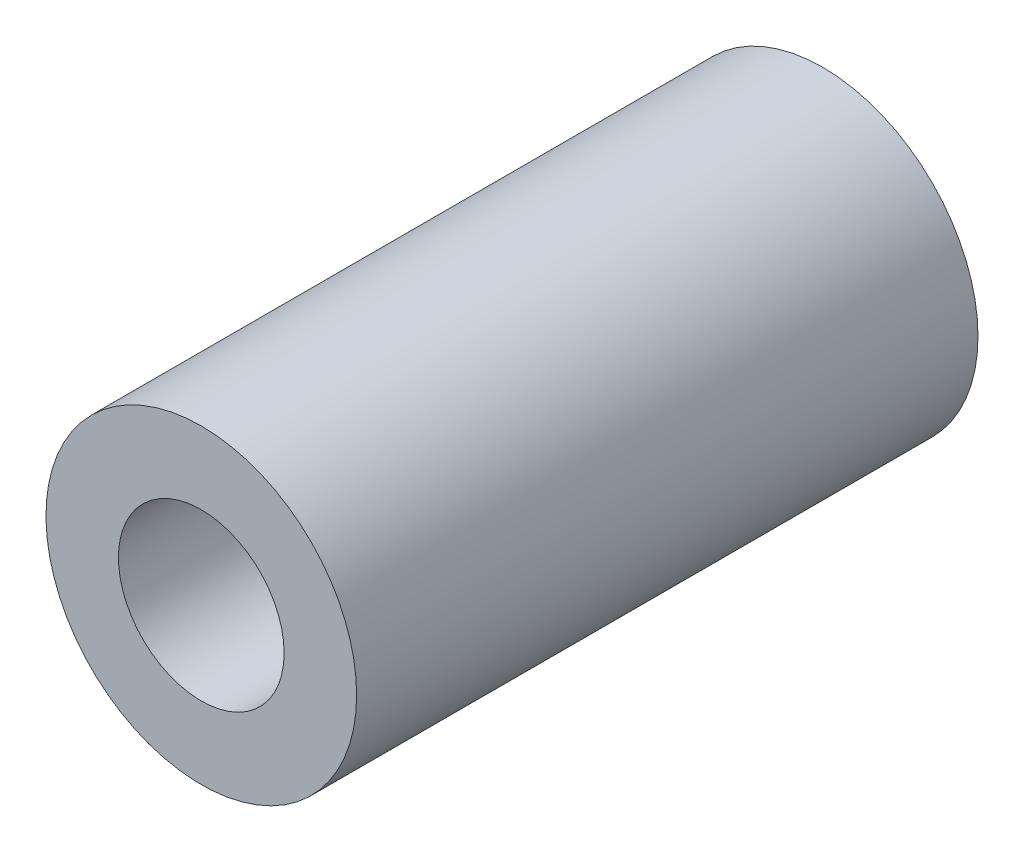
ISO-10303-21;
HEADER;
FILE_DESCRIPTION(('STEP AP214'),'2;1');
FILE_NAME('part.step','',(''),(''),'','','');
FILE_SCHEMA(('AUTOMOTIVE_DESIGN { 1 0 10303 214 1 1 1 1 }'));
ENDSEC;
DATA;
#1=APPLICATION_CONTEXT('core data for automotive mechanical design processes');
#2=APPLICATION_PROTOCOL_DEFINITION('international standard','automotive_design',2000,#1);
#3=PRODUCT_CONTEXT('',#1,'mechanical');
#4=PRODUCT('Part','Part','',(#3));
#5=PRODUCT_RELATED_PRODUCT_CATEGORY('part','',(#4));
#6=PRODUCT_DEFINITION_FORMATION('','',#4);
#7=PRODUCT_DEFINITION_CONTEXT('part definition',#1,'design');
#8=PRODUCT_DEFINITION('design','',#6,#7);
#9=PRODUCT_DEFINITION_SHAPE('','',#8);
#10=(LENGTH_UNIT() NAMED_UNIT(*) SI_UNIT(.MILLI.,.METRE.));
#11=(NAMED_UNIT(*) PLANE_ANGLE_UNIT() SI_UNIT($,.RADIAN.));
#12=(NAMED_UNIT(*) SI_UNIT($,.STERADIAN.) SOLID_ANGLE_UNIT());
#13=UNCERTAINTY_MEASURE_WITH_UNIT(LENGTH_MEASURE(1.E-05),#10,'distance_accuracy_value','');
#14=(GEOMETRIC_REPRESENTATION_CONTEXT(3) GLOBAL_UNCERTAINTY_ASSIGNED_CONTEXT((#13)) GLOBAL_UNIT_ASSIGNED_CONTEXT((#10,
#11,#12)) REPRESENTATION_CONTEXT('',''));
#15=CARTESIAN_POINT('',(0.,0.,0.));
#16=DIRECTION('',(0.,0.,1.));
#17=DIRECTION('',(1.,0.,0.));
#18=AXIS2_PLACEMENT_3D('',#15,#16,#17);
#19=CARTESIAN_POINT('',(4.000007620015,-96.00019304038,0.));
#20=DIRECTION('',(0.,0.,1.));
#21=DIRECTION('',(1.,0.,0.));
#22=AXIS2_PLACEMENT_3D('',#19,#20,#21);
#23=CYLINDRICAL_SURFACE('',#22,2.);
#24=CARTESIAN_POINT('',(4.000007620015,-96.00019304038,0.));
#25=DIRECTION('',(0.,0.,1.));
#26=DIRECTION('',(1.,0.,0.));
#27=AXIS2_PLACEMENT_3D('',#24,#25,#26);
#28=CIRCLE('',#27,2.);
#29=CARTESIAN_POINT('',(6.000007620015,-96.00019304038,0.));
#30=VERTEX_POINT('',#29);
#31=EDGE_CURVE('E108',#30,#30,#28,.T.);
#32=ORIENTED_EDGE('',*,*,#31,.F.);
#33=EDGE_LOOP('',(#32));
#34=FACE_BOUND('',#33,.T.);
#35=CARTESIAN_POINT('',(4.000007620015,-96.00019304038,2.));
#36=DIRECTION('',(0.,0.,1.));
#37=DIRECTION('',(1.,0.,0.));
#38=AXIS2_PLACEMENT_3D('',#35,#36,#37);
#39=CIRCLE('',#38,2.);
#40=CARTESIAN_POINT('',(6.000007620015,-96.00019304038,2.));
#41=VERTEX_POINT('',#40);
#42=EDGE_CURVE('E37',#41,#41,#39,.F.);
#43=ORIENTED_EDGE('',*,*,#42,.F.);
#44=EDGE_LOOP('',(#43));
#45=FACE_BOUND('',#44,.T.);
#46=ADVANCED_FACE('F33',(#34,#45),#23,.F.);
#47=CARTESIAN_POINT('',(4.000007620015,-96.00019304038,4.));
#48=DIRECTION('',(0.,0.,1.));
#49=DIRECTION('',(1.,0.,0.));
#50=AXIS2_PLACEMENT_3D('',#47,#48,#49);
#51=PLANE('',#50);
#52=CARTESIAN_POINT('',(9.65686181877431,-90.3433387401546,4.));
#53=DIRECTION('',(0.,0.,1.));
#54=DIRECTION('',(1.,0.,0.));
#55=AXIS2_PLACEMENT_3D('',#52,#53,#54);
#56=CIRCLE('',#55,3.75000000000001);
#57=CARTESIAN_POINT('',(7.0052114844493,-87.6916882155804,4.));
#58=VERTEX_POINT('',#57);
#59=CARTESIAN_POINT('',(12.3085123909107,-92.9949890269173,4.));
#60=VERTEX_POINT('',#59);
#61=EDGE_CURVE('E90',#58,#60,#56,.T.);
#62=ORIENTED_EDGE('',*,*,#61,.F.);
#63=DIRECTION('',(-0.707106806553095,-0.707106755819999,0.));
#64=VECTOR('',#63,1.);
#65=CARTESIAN_POINT('',(1.34835703202456,-93.3485422621404,4.));
#66=LINE('',#65,#64);
#67=CARTESIAN_POINT('',(1.34835703202456,-93.3485422621404,4.));
#68=VERTEX_POINT('',#67);
#69=EDGE_CURVE('E51',#58,#68,#66,.T.);
#70=ORIENTED_EDGE('',*,*,#69,.T.);
#71=CARTESIAN_POINT('',(4.000007620015,-96.00019304038,4.));
#72=DIRECTION('',(0.,0.,1.));
#73=DIRECTION('',(1.,0.,0.));
#74=AXIS2_PLACEMENT_3D('',#71,#72,#73);
#75=CIRCLE('',#74,3.75000035873714);
#76=CARTESIAN_POINT('',(6.65165844581684,-98.6518435808082,4.));
#77=VERTEX_POINT('',#76);
#78=EDGE_CURVE('E115',#68,#77,#75,.T.);
#79=ORIENTED_EDGE('',*,*,#78,.T.);
#80=DIRECTION('',(0.70710674313673,0.707106819236363,0.));
#81=VECTOR('',#80,1.);
#82=CARTESIAN_POINT('',(6.65165844581684,-98.6518435808082,4.));
#83=LINE('',#82,#81);
#84=EDGE_CURVE('E80',#77,#60,#83,.T.);
#85=ORIENTED_EDGE('',*,*,#84,.T.);
#86=EDGE_LOOP('',(#62,#70,#79,#85));
#87=FACE_BOUND('',#86,.T.);
#88=CARTESIAN_POINT('',(4.000007620015,-96.00019304038,4.));
#89=DIRECTION('',(0.,0.,1.));
#90=DIRECTION('',(1.,0.,0.));
#91=AXIS2_PLACEMENT_3D('',#88,#89,#90);
#92=CIRCLE('',#91,3.);
#93=CARTESIAN_POINT('',(7.000007620015,-96.00019304038,4.));
#94=VERTEX_POINT('',#93);
#95=EDGE_CURVE('E98',#94,#94,#92,.T.);
#96=ORIENTED_EDGE('',*,*,#95,.F.);
#97=EDGE_LOOP('',(#96));
#98=FACE_BOUND('',#97,.T.);
#99=ADVANCED_FACE('F92',(#87,#98),#51,.T.);
#100=CARTESIAN_POINT('',(4.000007620015,-96.00019304038,0.));
#101=DIRECTION('',(0.,0.,1.));
#102=DIRECTION('',(1.,0.,0.));
#103=AXIS2_PLACEMENT_3D('',#100,#101,#102);
#104=PLANE('',#103);
#105=ORIENTED_EDGE('',*,*,#31,.T.);
#106=EDGE_LOOP('',(#105));
#107=FACE_BOUND('',#106,.T.);
#108=CARTESIAN_POINT('',(4.000007620015,-96.00019304038,0.));
#109=DIRECTION('',(0.,0.,1.));
#110=DIRECTION('',(1.,0.,0.));
#111=AXIS2_PLACEMENT_3D('',#108,#109,#110);
#112=CIRCLE('',#111,3.75000035873714);
#113=CARTESIAN_POINT('',(1.34835703202456,-93.3485422621404,0.));
#114=VERTEX_POINT('',#113);
#115=CARTESIAN_POINT('',(6.65165844581684,-98.6518435808082,0.));
#116=VERTEX_POINT('',#115);
#117=EDGE_CURVE('E114',#114,#116,#112,.T.);
#118=ORIENTED_EDGE('',*,*,#117,.F.);
#119=DIRECTION('',(-0.707106806553095,-0.707106755819999,0.));
#120=VECTOR('',#119,1.);
#121=CARTESIAN_POINT('',(1.34835703202456,-93.3485422621404,0.));
#122=LINE('',#121,#120);
#123=CARTESIAN_POINT('',(7.00521148444931,-87.6916882155804,0.));
#124=VERTEX_POINT('',#123);
#125=EDGE_CURVE('E75',#124,#114,#122,.T.);
#126=ORIENTED_EDGE('',*,*,#125,.F.);
#127=CARTESIAN_POINT('',(9.65686181877431,-90.3433387401546,0.));
#128=DIRECTION('',(0.,0.,1.));
#129=DIRECTION('',(1.,0.,0.));
#130=AXIS2_PLACEMENT_3D('',#127,#128,#129);
#131=CIRCLE('',#130,3.75000000000001);
#132=CARTESIAN_POINT('',(12.3085123909107,-92.9949890269173,0.));
#133=VERTEX_POINT('',#132);
#134=EDGE_CURVE('E70',#133,#124,#131,.T.);
#135=ORIENTED_EDGE('',*,*,#134,.F.);
#136=DIRECTION('',(0.70710674313673,0.707106819236363,0.));
#137=VECTOR('',#136,1.);
#138=CARTESIAN_POINT('',(6.65165844581684,-98.6518435808082,0.));
#139=LINE('',#138,#137);
#140=EDGE_CURVE('E120',#116,#133,#139,.T.);
#141=ORIENTED_EDGE('',*,*,#140,.F.);
#142=EDGE_LOOP('',(#118,#126,#135,#141));
#143=FACE_BOUND('',#142,.T.);
#144=CARTESIAN_POINT('',(9.65686181877431,-90.3433387401546,0.));
#145=DIRECTION('',(0.,0.,1.));
#146=DIRECTION('',(1.,0.,0.));
#147=AXIS2_PLACEMENT_3D('',#144,#145,#146);
#148=CIRCLE('',#147,2.);
#149=CARTESIAN_POINT('',(11.6568618187743,-90.3433387401546,0.));
#150=VERTEX_POINT('',#149);
#151=EDGE_CURVE('E111',#150,#150,#148,.T.);
#152=ORIENTED_EDGE('',*,*,#151,.T.);
#153=EDGE_LOOP('',(#152));
#154=FACE_BOUND('',#153,.T.);
#155=ADVANCED_FACE('F127',(#107,#143,#154),#104,.F.);
#156=CARTESIAN_POINT('',(4.000007620015,-96.00019304038,4.));
#157=DIRECTION('',(0.,0.,-1.));
#158=DIRECTION('',(-1.,0.,0.));
#159=AXIS2_PLACEMENT_3D('',#156,#157,#158);
#160=CYLINDRICAL_SURFACE('',#159,3.75000035873714);
#161=ORIENTED_EDGE('',*,*,#117,.T.);
#162=DIRECTION('',(0.,0.,-1.));
#163=VECTOR('',#162,1.);
#164=CARTESIAN_POINT('',(6.65165844581684,-98.6518435808082,4.));
#165=LINE('',#164,#163);
#166=EDGE_CURVE('E11',#77,#116,#165,.T.);
#167=ORIENTED_EDGE('',*,*,#166,.F.);
#168=ORIENTED_EDGE('',*,*,#78,.F.);
#169=DIRECTION('',(0.,0.,-1.));
#170=VECTOR('',#169,1.);
#171=CARTESIAN_POINT('',(1.34835703202456,-93.3485422621404,4.));
#172=LINE('',#171,#170);
#173=EDGE_CURVE('E84',#68,#114,#172,.T.);
#174=ORIENTED_EDGE('',*,*,#173,.T.);
#175=EDGE_LOOP('',(#161,#167,#168,#174));
#176=FACE_BOUND('',#175,.T.);
#177=ADVANCED_FACE('F35',(#176),#160,.T.);
#178=CARTESIAN_POINT('',(6.65165844581684,-98.6518435808082,4.));
#179=DIRECTION('',(-0.707106819236363,0.70710674313673,0.));
#180=DIRECTION('',(-0.70710674313673,-0.707106819236363,0.));
#181=AXIS2_PLACEMENT_3D('',#178,#179,#180);
#182=PLANE('',#181);
#183=ORIENTED_EDGE('',*,*,#140,.T.);
#184=DIRECTION('',(0.,0.,-1.));
#185=VECTOR('',#184,1.);
#186=CARTESIAN_POINT('',(12.3085123909107,-92.9949890269173,4.));
#187=LINE('',#186,#185);
#188=EDGE_CURVE('E43',#60,#133,#187,.T.);
#189=ORIENTED_EDGE('',*,*,#188,.F.);
#190=ORIENTED_EDGE('',*,*,#84,.F.);
#191=ORIENTED_EDGE('',*,*,#166,.T.);
#192=EDGE_LOOP('',(#183,#189,#190,#191));
#193=FACE_BOUND('',#192,.T.);
#194=ADVANCED_FACE('F131',(#193),#182,.F.);
#195=CARTESIAN_POINT('',(9.65686181877431,-90.3433387401546,4.));
#196=DIRECTION('',(0.,0.,-1.));
#197=DIRECTION('',(-1.,0.,0.));
#198=AXIS2_PLACEMENT_3D('',#195,#196,#197);
#199=CYLINDRICAL_SURFACE('',#198,3.75000000000001);
#200=ORIENTED_EDGE('',*,*,#134,.T.);
#201=DIRECTION('',(0.,0.,-1.));
#202=VECTOR('',#201,1.);
#203=CARTESIAN_POINT('',(7.00521148444931,-87.6916882155804,4.));
#204=LINE('',#203,#202);
#205=EDGE_CURVE('E83',#58,#124,#204,.T.);
#206=ORIENTED_EDGE('',*,*,#205,.F.);
#207=ORIENTED_EDGE('',*,*,#61,.T.);
#208=ORIENTED_EDGE('',*,*,#188,.T.);
#209=EDGE_LOOP('',(#200,#206,#207,#208));
#210=FACE_BOUND('',#209,.T.);
#211=CARTESIAN_POINT('',(9.65686181877431,-90.3433387401546,15.));
#212=DIRECTION('',(0.,0.,1.));
#213=DIRECTION('',(1.,0.,0.));
#214=AXIS2_PLACEMENT_3D('',#211,#212,#213);
#215=CIRCLE('',#214,3.75000000000001);
#216=CARTESIAN_POINT('',(13.4068618187743,-90.3433387401546,15.));
#217=VERTEX_POINT('',#216);
#218=EDGE_CURVE('E94',#217,#217,#215,.T.);
#219=ORIENTED_EDGE('',*,*,#218,.F.);
#220=EDGE_LOOP('',(#219));
#221=FACE_BOUND('',#220,.T.);
#222=ADVANCED_FACE('F88',(#210,#221),#199,.T.);
#223=CARTESIAN_POINT('',(1.34835703202456,-93.3485422621404,4.));
#224=DIRECTION('',(0.707106755819999,-0.707106806553095,0.));
#225=DIRECTION('',(0.707106806553095,0.707106755819999,0.));
#226=AXIS2_PLACEMENT_3D('',#223,#224,#225);
#227=PLANE('',#226);
#228=ORIENTED_EDGE('',*,*,#125,.T.);
#229=ORIENTED_EDGE('',*,*,#173,.F.);
#230=ORIENTED_EDGE('',*,*,#69,.F.);
#231=ORIENTED_EDGE('',*,*,#205,.T.);
#232=EDGE_LOOP('',(#228,#229,#230,#231));
#233=FACE_BOUND('',#232,.T.);
#234=ADVANCED_FACE('F82',(#233),#227,.F.);
#235=CARTESIAN_POINT('',(9.65686181877431,-90.3433387401546,4.));
#236=DIRECTION('',(0.,0.,-1.));
#237=DIRECTION('',(-1.,0.,0.));
#238=AXIS2_PLACEMENT_3D('',#235,#236,#237);
#239=CYLINDRICAL_SURFACE('',#238,2.);
#240=ORIENTED_EDGE('',*,*,#151,.F.);
#241=EDGE_LOOP('',(#240));
#242=FACE_BOUND('',#241,.T.);
#243=CARTESIAN_POINT('',(9.65686181877431,-90.3433387401546,15.));
#244=DIRECTION('',(0.,0.,1.));
#245=DIRECTION('',(1.,0.,0.));
#246=AXIS2_PLACEMENT_3D('',#243,#244,#245);
#247=CIRCLE('',#246,2.);
#248=CARTESIAN_POINT('',(11.6568618187743,-90.3433387401546,15.));
#249=VERTEX_POINT('',#248);
#250=EDGE_CURVE('E95',#249,#249,#247,.T.);
#251=ORIENTED_EDGE('',*,*,#250,.T.);
#252=EDGE_LOOP('',(#251));
#253=FACE_BOUND('',#252,.T.);
#254=ADVANCED_FACE('F151',(#242,#253),#239,.F.);
#255=CARTESIAN_POINT('',(4.000007620015,-96.00019304038,2.));
#256=DIRECTION('',(0.,0.,1.));
#257=DIRECTION('',(1.,0.,0.));
#258=AXIS2_PLACEMENT_3D('',#255,#256,#257);
#259=PLANE('',#258);
#260=CARTESIAN_POINT('',(4.000007620015,-96.00019304038,2.));
#261=DIRECTION('',(0.,0.,1.));
#262=DIRECTION('',(1.,0.,0.));
#263=AXIS2_PLACEMENT_3D('',#260,#261,#262);
#264=CIRCLE('',#263,3.);
#265=CARTESIAN_POINT('',(7.000007620015,-96.00019304038,2.));
#266=VERTEX_POINT('',#265);
#267=EDGE_CURVE('E103',#266,#266,#264,.T.);
#268=ORIENTED_EDGE('',*,*,#267,.T.);
#269=EDGE_LOOP('',(#268));
#270=FACE_BOUND('',#269,.T.);
#271=ORIENTED_EDGE('',*,*,#42,.T.);
#272=EDGE_LOOP('',(#271));
#273=FACE_BOUND('',#272,.T.);
#274=ADVANCED_FACE('F153',(#270,#273),#259,.T.);
#275=CARTESIAN_POINT('',(4.000007620015,-96.00019304038,2.));
#276=DIRECTION('',(0.,0.,1.));
#277=DIRECTION('',(1.,0.,0.));
#278=AXIS2_PLACEMENT_3D('',#275,#276,#277);
#279=CYLINDRICAL_SURFACE('',#278,3.);
#280=ORIENTED_EDGE('',*,*,#267,.F.);
#281=EDGE_LOOP('',(#280));
#282=FACE_BOUND('',#281,.T.);
#283=ORIENTED_EDGE('',*,*,#95,.T.);
#284=EDGE_LOOP('',(#283));
#285=FACE_BOUND('',#284,.T.);
#286=ADVANCED_FACE('F149',(#282,#285),#279,.F.);
#287=CARTESIAN_POINT('',(9.65686181877431,-90.3433387401546,15.));
#288=DIRECTION('',(0.,0.,1.));
#289=DIRECTION('',(1.,0.,0.));
#290=AXIS2_PLACEMENT_3D('',#287,#288,#289);
#291=PLANE('',#290);
#292=ORIENTED_EDGE('',*,*,#218,.T.);
#293=EDGE_LOOP('',(#292));
#294=FACE_BOUND('',#293,.T.);
#295=ORIENTED_EDGE('',*,*,#250,.F.);
#296=EDGE_LOOP('',(#295));
#297=FACE_BOUND('',#296,.T.);
#298=ADVANCED_FACE('F183',(#294,#297),#291,.T.);
#299=CLOSED_SHELL('',(#46,#99,#155,#177,#194,#222,#234,#254,#274,#286,#298));
#300=MANIFOLD_SOLID_BREP('B2',#299);
#301=ADVANCED_BREP_SHAPE_REPRESENTATION('',(#18,#300),#14);
#302=SHAPE_DEFINITION_REPRESENTATION(#9,#301);
ENDSEC;
END-ISO-10303-21;
